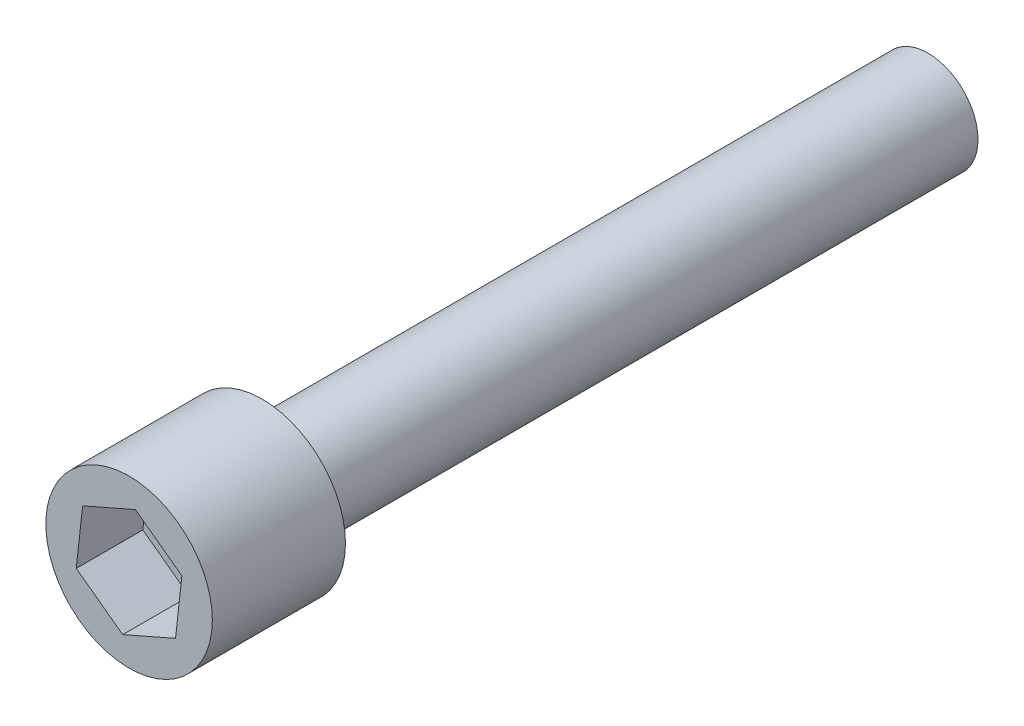
ISO-10303-21;
HEADER;
FILE_DESCRIPTION(('STEP AP214'),'2;1');
FILE_NAME('part.step','',(''),(''),'','','');
FILE_SCHEMA(('AUTOMOTIVE_DESIGN { 1 0 10303 214 1 1 1 1 }'));
ENDSEC;
DATA;
#1=APPLICATION_CONTEXT('core data for automotive mechanical design processes');
#2=APPLICATION_PROTOCOL_DEFINITION('international standard','automotive_design',2000,#1);
#3=PRODUCT_CONTEXT('',#1,'mechanical');
#4=PRODUCT('Part','Part','',(#3));
#5=PRODUCT_RELATED_PRODUCT_CATEGORY('part','',(#4));
#6=PRODUCT_DEFINITION_FORMATION('','',#4);
#7=PRODUCT_DEFINITION_CONTEXT('part definition',#1,'design');
#8=PRODUCT_DEFINITION('design','',#6,#7);
#9=PRODUCT_DEFINITION_SHAPE('','',#8);
#10=(LENGTH_UNIT() NAMED_UNIT(*) SI_UNIT(.MILLI.,.METRE.));
#11=(NAMED_UNIT(*) PLANE_ANGLE_UNIT() SI_UNIT($,.RADIAN.));
#12=(NAMED_UNIT(*) SI_UNIT($,.STERADIAN.) SOLID_ANGLE_UNIT());
#13=UNCERTAINTY_MEASURE_WITH_UNIT(LENGTH_MEASURE(1.E-05),#10,'distance_accuracy_value','');
#14=(GEOMETRIC_REPRESENTATION_CONTEXT(3) GLOBAL_UNCERTAINTY_ASSIGNED_CONTEXT((#13)) GLOBAL_UNIT_ASSIGNED_CONTEXT((#10,
#11,#12)) REPRESENTATION_CONTEXT('',''));
#15=CARTESIAN_POINT('',(0.,0.,0.));
#16=DIRECTION('',(0.,0.,1.));
#17=DIRECTION('',(1.,0.,0.));
#18=AXIS2_PLACEMENT_3D('',#15,#16,#17);
#19=CARTESIAN_POINT('',(0.,0.,8.));
#20=DIRECTION('',(0.,0.,-1.));
#21=DIRECTION('',(-1.,0.,0.));
#22=AXIS2_PLACEMENT_3D('',#19,#20,#21);
#23=CYLINDRICAL_SURFACE('',#22,5.);
#24=CARTESIAN_POINT('',(0.,0.,8.));
#25=DIRECTION('',(0.,0.,1.));
#26=DIRECTION('',(1.,0.,0.));
#27=AXIS2_PLACEMENT_3D('',#24,#25,#26);
#28=CIRCLE('',#27,5.);
#29=CARTESIAN_POINT('',(5.,0.,8.));
#30=VERTEX_POINT('',#29);
#31=EDGE_CURVE('E11',#30,#30,#28,.T.);
#32=ORIENTED_EDGE('',*,*,#31,.F.);
#33=EDGE_LOOP('',(#32));
#34=FACE_BOUND('',#33,.T.);
#35=CARTESIAN_POINT('',(0.,0.,0.));
#36=DIRECTION('',(0.,0.,1.));
#37=DIRECTION('',(1.,0.,0.));
#38=AXIS2_PLACEMENT_3D('',#35,#36,#37);
#39=CIRCLE('',#38,5.);
#40=CARTESIAN_POINT('',(5.,0.,0.));
#41=VERTEX_POINT('',#40);
#42=EDGE_CURVE('E39',#41,#41,#39,.T.);
#43=ORIENTED_EDGE('',*,*,#42,.T.);
#44=EDGE_LOOP('',(#43));
#45=FACE_BOUND('',#44,.T.);
#46=ADVANCED_FACE('F36',(#34,#45),#23,.T.);
#47=CARTESIAN_POINT('',(0.,0.,8.));
#48=DIRECTION('',(0.,0.,1.));
#49=DIRECTION('',(1.,0.,0.));
#50=AXIS2_PLACEMENT_3D('',#47,#48,#49);
#51=PLANE('',#50);
#52=DIRECTION('',(0.915729989511724,0.401794208904082,0.));
#53=VECTOR('',#52,1.);
#54=CARTESIAN_POINT('',(-0.380708241136574,-3.44311795254399,8.));
#55=LINE('',#54,#53);
#56=CARTESIAN_POINT('',(-0.380708241136574,-3.44311795254399,8.));
#57=VERTEX_POINT('',#56);
#58=CARTESIAN_POINT('',(2.79147349456107,-2.05126198452636,8.));
#59=VERTEX_POINT('',#58);
#60=EDGE_CURVE('E50',#57,#59,#55,.T.);
#61=ORIENTED_EDGE('',*,*,#60,.F.);
#62=DIRECTION('',(0.805828986760269,-0.59214832947237,0.));
#63=VECTOR('',#62,1.);
#64=CARTESIAN_POINT('',(-3.17218173569764,-1.39185596801763,8.));
#65=LINE('',#64,#63);
#66=CARTESIAN_POINT('',(-3.17218173569764,-1.39185596801763,8.));
#67=VERTEX_POINT('',#66);
#68=EDGE_CURVE('E133',#67,#57,#65,.T.);
#69=ORIENTED_EDGE('',*,*,#68,.F.);
#70=DIRECTION('',(-0.109901002751455,-0.993942538376452,0.));
#71=VECTOR('',#70,1.);
#72=CARTESIAN_POINT('',(-2.79147349456107,2.05126198452636,8.));
#73=LINE('',#72,#71);
#74=CARTESIAN_POINT('',(-2.79147349456107,2.05126198452636,8.));
#75=VERTEX_POINT('',#74);
#76=EDGE_CURVE('E131',#75,#67,#73,.T.);
#77=ORIENTED_EDGE('',*,*,#76,.F.);
#78=DIRECTION('',(-0.915729989511724,-0.401794208904082,0.));
#79=VECTOR('',#78,1.);
#80=CARTESIAN_POINT('',(0.380708241136576,3.44311795254399,8.));
#81=LINE('',#80,#79);
#82=CARTESIAN_POINT('',(0.380708241136576,3.44311795254399,8.));
#83=VERTEX_POINT('',#82);
#84=EDGE_CURVE('E98',#83,#75,#81,.T.);
#85=ORIENTED_EDGE('',*,*,#84,.F.);
#86=DIRECTION('',(-0.805828986760269,0.59214832947237,0.));
#87=VECTOR('',#86,1.);
#88=CARTESIAN_POINT('',(3.17218173569764,1.39185596801763,8.));
#89=LINE('',#88,#87);
#90=CARTESIAN_POINT('',(3.17218173569764,1.39185596801763,8.));
#91=VERTEX_POINT('',#90);
#92=EDGE_CURVE('E127',#91,#83,#89,.T.);
#93=ORIENTED_EDGE('',*,*,#92,.F.);
#94=DIRECTION('',(0.109901002751455,0.993942538376452,0.));
#95=VECTOR('',#94,1.);
#96=CARTESIAN_POINT('',(2.79147349456107,-2.05126198452636,8.));
#97=LINE('',#96,#95);
#98=EDGE_CURVE('E124',#59,#91,#97,.T.);
#99=ORIENTED_EDGE('',*,*,#98,.F.);
#100=EDGE_LOOP('',(#61,#69,#77,#85,#93,#99));
#101=FACE_BOUND('',#100,.T.);
#102=ORIENTED_EDGE('',*,*,#31,.T.);
#103=EDGE_LOOP('',(#102));
#104=FACE_BOUND('',#103,.T.);
#105=ADVANCED_FACE('F164',(#101,#104),#51,.T.);
#106=CARTESIAN_POINT('',(0.,0.,0.));
#107=DIRECTION('',(0.,0.,1.));
#108=DIRECTION('',(1.,0.,0.));
#109=AXIS2_PLACEMENT_3D('',#106,#107,#108);
#110=PLANE('',#109);
#111=CARTESIAN_POINT('',(0.,0.,0.));
#112=DIRECTION('',(0.,0.,1.));
#113=DIRECTION('',(1.,0.,0.));
#114=AXIS2_PLACEMENT_3D('',#111,#112,#113);
#115=CIRCLE('',#114,3.);
#116=CARTESIAN_POINT('',(3.,0.,0.));
#117=VERTEX_POINT('',#116);
#118=EDGE_CURVE('E137',#117,#117,#115,.T.);
#119=ORIENTED_EDGE('',*,*,#118,.T.);
#120=EDGE_LOOP('',(#119));
#121=FACE_BOUND('',#120,.T.);
#122=ORIENTED_EDGE('',*,*,#42,.F.);
#123=EDGE_LOOP('',(#122));
#124=FACE_BOUND('',#123,.T.);
#125=ADVANCED_FACE('F149',(#121,#124),#110,.F.);
#126=CARTESIAN_POINT('',(0.,0.,-40.));
#127=DIRECTION('',(0.,0.,1.));
#128=DIRECTION('',(1.,0.,0.));
#129=AXIS2_PLACEMENT_3D('',#126,#127,#128);
#130=CYLINDRICAL_SURFACE('',#129,3.);
#131=CARTESIAN_POINT('',(0.,0.,-40.));
#132=DIRECTION('',(0.,0.,1.));
#133=DIRECTION('',(1.,0.,0.));
#134=AXIS2_PLACEMENT_3D('',#131,#132,#133);
#135=CIRCLE('',#134,3.);
#136=CARTESIAN_POINT('',(3.,0.,-40.));
#137=VERTEX_POINT('',#136);
#138=EDGE_CURVE('E143',#137,#137,#135,.T.);
#139=ORIENTED_EDGE('',*,*,#138,.T.);
#140=EDGE_LOOP('',(#139));
#141=FACE_BOUND('',#140,.T.);
#142=ORIENTED_EDGE('',*,*,#118,.F.);
#143=EDGE_LOOP('',(#142));
#144=FACE_BOUND('',#143,.T.);
#145=ADVANCED_FACE('F152',(#141,#144),#130,.T.);
#146=CARTESIAN_POINT('',(0.,0.,-40.));
#147=DIRECTION('',(0.,0.,1.));
#148=DIRECTION('',(1.,0.,0.));
#149=AXIS2_PLACEMENT_3D('',#146,#147,#148);
#150=PLANE('',#149);
#151=ORIENTED_EDGE('',*,*,#138,.F.);
#152=EDGE_LOOP('',(#151));
#153=FACE_BOUND('',#152,.T.);
#154=ADVANCED_FACE('F154',(#153),#150,.F.);
#155=CARTESIAN_POINT('',(-0.380708241136574,-3.44311795254399,4.));
#156=DIRECTION('',(0.401794208904082,-0.915729989511724,0.));
#157=DIRECTION('',(0.915729989511725,0.401794208904082,0.));
#158=AXIS2_PLACEMENT_3D('',#155,#156,#157);
#159=PLANE('',#158);
#160=ORIENTED_EDGE('',*,*,#60,.T.);
#161=DIRECTION('',(0.,0.,1.));
#162=VECTOR('',#161,1.);
#163=CARTESIAN_POINT('',(2.79147349456107,-2.05126198452636,4.));
#164=LINE('',#163,#162);
#165=CARTESIAN_POINT('',(2.79147349456107,-2.05126198452636,4.));
#166=VERTEX_POINT('',#165);
#167=EDGE_CURVE('E80',#166,#59,#164,.T.);
#168=ORIENTED_EDGE('',*,*,#167,.F.);
#169=DIRECTION('',(0.915729989511724,0.401794208904082,0.));
#170=VECTOR('',#169,1.);
#171=CARTESIAN_POINT('',(-0.380708241136574,-3.44311795254399,4.));
#172=LINE('',#171,#170);
#173=CARTESIAN_POINT('',(-0.380708241136574,-3.44311795254399,4.));
#174=VERTEX_POINT('',#173);
#175=EDGE_CURVE('E135',#174,#166,#172,.T.);
#176=ORIENTED_EDGE('',*,*,#175,.F.);
#177=DIRECTION('',(0.,0.,1.));
#178=VECTOR('',#177,1.);
#179=CARTESIAN_POINT('',(-0.380708241136574,-3.44311795254399,4.));
#180=LINE('',#179,#178);
#181=EDGE_CURVE('E58',#174,#57,#180,.T.);
#182=ORIENTED_EDGE('',*,*,#181,.T.);
#183=EDGE_LOOP('',(#160,#168,#176,#182));
#184=FACE_BOUND('',#183,.T.);
#185=ADVANCED_FACE('F161',(#184),#159,.F.);
#186=CARTESIAN_POINT('',(-3.17218173569764,-1.39185596801763,4.));
#187=DIRECTION('',(-0.59214832947237,-0.805828986760269,0.));
#188=DIRECTION('',(0.805828986760269,-0.59214832947237,0.));
#189=AXIS2_PLACEMENT_3D('',#186,#187,#188);
#190=PLANE('',#189);
#191=ORIENTED_EDGE('',*,*,#68,.T.);
#192=ORIENTED_EDGE('',*,*,#181,.F.);
#193=DIRECTION('',(0.805828986760269,-0.59214832947237,0.));
#194=VECTOR('',#193,1.);
#195=CARTESIAN_POINT('',(-3.17218173569764,-1.39185596801763,4.));
#196=LINE('',#195,#194);
#197=CARTESIAN_POINT('',(-3.17218173569764,-1.39185596801763,4.));
#198=VERTEX_POINT('',#197);
#199=EDGE_CURVE('E110',#198,#174,#196,.T.);
#200=ORIENTED_EDGE('',*,*,#199,.F.);
#201=DIRECTION('',(0.,0.,1.));
#202=VECTOR('',#201,1.);
#203=CARTESIAN_POINT('',(-3.17218173569764,-1.39185596801763,4.));
#204=LINE('',#203,#202);
#205=EDGE_CURVE('E102',#198,#67,#204,.T.);
#206=ORIENTED_EDGE('',*,*,#205,.T.);
#207=EDGE_LOOP('',(#191,#192,#200,#206));
#208=FACE_BOUND('',#207,.T.);
#209=ADVANCED_FACE('F186',(#208),#190,.F.);
#210=CARTESIAN_POINT('',(-2.79147349456107,2.05126198452636,4.));
#211=DIRECTION('',(-0.993942538376452,0.109901002751455,0.));
#212=DIRECTION('',(-0.109901002751455,-0.993942538376452,0.));
#213=AXIS2_PLACEMENT_3D('',#210,#211,#212);
#214=PLANE('',#213);
#215=ORIENTED_EDGE('',*,*,#76,.T.);
#216=ORIENTED_EDGE('',*,*,#205,.F.);
#217=DIRECTION('',(-0.109901002751455,-0.993942538376452,0.));
#218=VECTOR('',#217,1.);
#219=CARTESIAN_POINT('',(-2.79147349456107,2.05126198452636,4.));
#220=LINE('',#219,#218);
#221=CARTESIAN_POINT('',(-2.79147349456107,2.05126198452636,4.));
#222=VERTEX_POINT('',#221);
#223=EDGE_CURVE('E106',#222,#198,#220,.T.);
#224=ORIENTED_EDGE('',*,*,#223,.F.);
#225=DIRECTION('',(0.,0.,1.));
#226=VECTOR('',#225,1.);
#227=CARTESIAN_POINT('',(-2.79147349456107,2.05126198452636,4.));
#228=LINE('',#227,#226);
#229=EDGE_CURVE('E91',#222,#75,#228,.T.);
#230=ORIENTED_EDGE('',*,*,#229,.T.);
#231=EDGE_LOOP('',(#215,#216,#224,#230));
#232=FACE_BOUND('',#231,.T.);
#233=ADVANCED_FACE('F107',(#232),#214,.F.);
#234=CARTESIAN_POINT('',(0.380708241136576,3.44311795254399,4.));
#235=DIRECTION('',(-0.401794208904082,0.915729989511724,0.));
#236=DIRECTION('',(-0.915729989511724,-0.401794208904082,0.));
#237=AXIS2_PLACEMENT_3D('',#234,#235,#236);
#238=PLANE('',#237);
#239=ORIENTED_EDGE('',*,*,#84,.T.);
#240=ORIENTED_EDGE('',*,*,#229,.F.);
#241=DIRECTION('',(-0.915729989511724,-0.401794208904082,0.));
#242=VECTOR('',#241,1.);
#243=CARTESIAN_POINT('',(0.380708241136576,3.44311795254399,4.));
#244=LINE('',#243,#242);
#245=CARTESIAN_POINT('',(0.380708241136576,3.44311795254399,4.));
#246=VERTEX_POINT('',#245);
#247=EDGE_CURVE('E95',#246,#222,#244,.T.);
#248=ORIENTED_EDGE('',*,*,#247,.F.);
#249=DIRECTION('',(0.,0.,1.));
#250=VECTOR('',#249,1.);
#251=CARTESIAN_POINT('',(0.380708241136576,3.44311795254399,4.));
#252=LINE('',#251,#250);
#253=EDGE_CURVE('E103',#246,#83,#252,.T.);
#254=ORIENTED_EDGE('',*,*,#253,.T.);
#255=EDGE_LOOP('',(#239,#240,#248,#254));
#256=FACE_BOUND('',#255,.T.);
#257=ADVANCED_FACE('F93',(#256),#238,.F.);
#258=CARTESIAN_POINT('',(3.17218173569764,1.39185596801763,4.));
#259=DIRECTION('',(0.59214832947237,0.805828986760269,0.));
#260=DIRECTION('',(-0.805828986760269,0.59214832947237,0.));
#261=AXIS2_PLACEMENT_3D('',#258,#259,#260);
#262=PLANE('',#261);
#263=ORIENTED_EDGE('',*,*,#92,.T.);
#264=ORIENTED_EDGE('',*,*,#253,.F.);
#265=DIRECTION('',(-0.805828986760269,0.59214832947237,0.));
#266=VECTOR('',#265,1.);
#267=CARTESIAN_POINT('',(3.17218173569764,1.39185596801763,4.));
#268=LINE('',#267,#266);
#269=CARTESIAN_POINT('',(3.17218173569764,1.39185596801763,4.));
#270=VERTEX_POINT('',#269);
#271=EDGE_CURVE('E116',#270,#246,#268,.T.);
#272=ORIENTED_EDGE('',*,*,#271,.F.);
#273=DIRECTION('',(0.,0.,1.));
#274=VECTOR('',#273,1.);
#275=CARTESIAN_POINT('',(3.17218173569764,1.39185596801763,4.));
#276=LINE('',#275,#274);
#277=EDGE_CURVE('E140',#270,#91,#276,.T.);
#278=ORIENTED_EDGE('',*,*,#277,.T.);
#279=EDGE_LOOP('',(#263,#264,#272,#278));
#280=FACE_BOUND('',#279,.T.);
#281=ADVANCED_FACE('F195',(#280),#262,.F.);
#282=CARTESIAN_POINT('',(2.79147349456107,-2.05126198452636,4.));
#283=DIRECTION('',(0.993942538376452,-0.109901002751455,0.));
#284=DIRECTION('',(0.109901002751455,0.993942538376452,0.));
#285=AXIS2_PLACEMENT_3D('',#282,#283,#284);
#286=PLANE('',#285);
#287=ORIENTED_EDGE('',*,*,#98,.T.);
#288=ORIENTED_EDGE('',*,*,#277,.F.);
#289=DIRECTION('',(0.109901002751455,0.993942538376452,0.));
#290=VECTOR('',#289,1.);
#291=CARTESIAN_POINT('',(2.79147349456107,-2.05126198452636,4.));
#292=LINE('',#291,#290);
#293=EDGE_CURVE('E118',#166,#270,#292,.T.);
#294=ORIENTED_EDGE('',*,*,#293,.F.);
#295=ORIENTED_EDGE('',*,*,#167,.T.);
#296=EDGE_LOOP('',(#287,#288,#294,#295));
#297=FACE_BOUND('',#296,.T.);
#298=ADVANCED_FACE('F183',(#297),#286,.F.);
#299=CARTESIAN_POINT('',(0.,0.,4.));
#300=DIRECTION('',(0.,0.,1.));
#301=DIRECTION('',(1.,0.,0.));
#302=AXIS2_PLACEMENT_3D('',#299,#300,#301);
#303=PLANE('',#302);
#304=ORIENTED_EDGE('',*,*,#175,.T.);
#305=ORIENTED_EDGE('',*,*,#293,.T.);
#306=ORIENTED_EDGE('',*,*,#271,.T.);
#307=ORIENTED_EDGE('',*,*,#247,.T.);
#308=ORIENTED_EDGE('',*,*,#223,.T.);
#309=ORIENTED_EDGE('',*,*,#199,.T.);
#310=EDGE_LOOP('',(#304,#305,#306,#307,#308,#309));
#311=FACE_BOUND('',#310,.T.);
#312=ADVANCED_FACE('F113',(#311),#303,.T.);
#313=CLOSED_SHELL('',(#46,#105,#125,#145,#154,#185,#209,#233,#257,#281,#298,#312));
#314=MANIFOLD_SOLID_BREP('B2',#313);
#315=ADVANCED_BREP_SHAPE_REPRESENTATION('',(#18,#314),#14);
#316=SHAPE_DEFINITION_REPRESENTATION(#9,#315);
ENDSEC;
END-ISO-10303-21;
